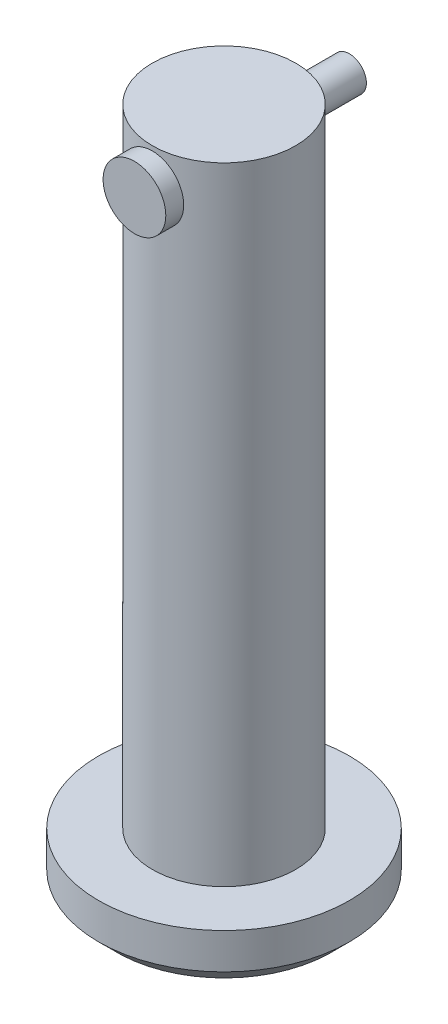
ISO-10303-21;
HEADER;
FILE_DESCRIPTION(('STEP AP214'),'2;1');
FILE_NAME('part.step','',(''),(''),'','','');
FILE_SCHEMA(('AUTOMOTIVE_DESIGN { 1 0 10303 214 1 1 1 1 }'));
ENDSEC;
DATA;
#1=APPLICATION_CONTEXT('core data for automotive mechanical design processes');
#2=APPLICATION_PROTOCOL_DEFINITION('international standard','automotive_design',2000,#1);
#3=PRODUCT_CONTEXT('',#1,'mechanical');
#4=PRODUCT('Part','Part','',(#3));
#5=PRODUCT_RELATED_PRODUCT_CATEGORY('part','',(#4));
#6=PRODUCT_DEFINITION_FORMATION('','',#4);
#7=PRODUCT_DEFINITION_CONTEXT('part definition',#1,'design');
#8=PRODUCT_DEFINITION('design','',#6,#7);
#9=PRODUCT_DEFINITION_SHAPE('','',#8);
#10=(LENGTH_UNIT() NAMED_UNIT(*) SI_UNIT(.MILLI.,.METRE.));
#11=(NAMED_UNIT(*) PLANE_ANGLE_UNIT() SI_UNIT($,.RADIAN.));
#12=(NAMED_UNIT(*) SI_UNIT($,.STERADIAN.) SOLID_ANGLE_UNIT());
#13=UNCERTAINTY_MEASURE_WITH_UNIT(LENGTH_MEASURE(1.E-05),#10,'distance_accuracy_value','');
#14=(GEOMETRIC_REPRESENTATION_CONTEXT(3) GLOBAL_UNCERTAINTY_ASSIGNED_CONTEXT((#13)) GLOBAL_UNIT_ASSIGNED_CONTEXT((#10,
#11,#12)) REPRESENTATION_CONTEXT('',''));
#15=CARTESIAN_POINT('',(0.,0.,0.));
#16=DIRECTION('',(0.,0.,1.));
#17=DIRECTION('',(1.,0.,0.));
#18=AXIS2_PLACEMENT_3D('',#15,#16,#17);
#19=CARTESIAN_POINT('',(0.,33.,-7.));
#20=DIRECTION('',(0.,0.,1.));
#21=DIRECTION('',(1.,0.,0.));
#22=AXIS2_PLACEMENT_3D('',#19,#20,#21);
#23=CYLINDRICAL_SURFACE('',#22,0.95);
#24=CARTESIAN_POINT('',(0.,33.,-7.));
#25=DIRECTION('',(0.,0.,1.));
#26=DIRECTION('',(1.,0.,0.));
#27=AXIS2_PLACEMENT_3D('',#24,#25,#26);
#28=CIRCLE('',#27,0.95);
#29=CARTESIAN_POINT('',(0.95,33.,-7.));
#30=VERTEX_POINT('',#29);
#31=EDGE_CURVE('E11',#30,#30,#28,.T.);
#32=ORIENTED_EDGE('',*,*,#31,.T.);
#33=EDGE_LOOP('',(#32));
#34=FACE_BOUND('',#33,.T.);
#35=CARTESIAN_POINT('',(0.,33.,4.));
#36=DIRECTION('',(0.,0.,1.));
#37=DIRECTION('',(1.,0.,0.));
#38=AXIS2_PLACEMENT_3D('',#35,#36,#37);
#39=CIRCLE('',#38,0.95);
#40=CARTESIAN_POINT('',(0.95,33.,4.));
#41=VERTEX_POINT('',#40);
#42=EDGE_CURVE('E44',#41,#41,#39,.F.);
#43=ORIENTED_EDGE('',*,*,#42,.T.);
#44=EDGE_LOOP('',(#43));
#45=FACE_BOUND('',#44,.T.);
#46=ADVANCED_FACE('F41',(#34,#45),#23,.T.);
#47=CARTESIAN_POINT('',(0.,33.,-7.));
#48=DIRECTION('',(0.,0.,1.));
#49=DIRECTION('',(1.,0.,0.));
#50=AXIS2_PLACEMENT_3D('',#47,#48,#49);
#51=PLANE('',#50);
#52=ORIENTED_EDGE('',*,*,#31,.F.);
#53=EDGE_LOOP('',(#52));
#54=FACE_BOUND('',#53,.T.);
#55=ADVANCED_FACE('F73',(#54),#51,.F.);
#56=CARTESIAN_POINT('',(0.,33.,4.));
#57=DIRECTION('',(0.,0.,1.));
#58=DIRECTION('',(1.,0.,0.));
#59=AXIS2_PLACEMENT_3D('',#56,#57,#58);
#60=CYLINDRICAL_SURFACE('',#59,1.75);
#61=CARTESIAN_POINT('',(0.,33.,4.));
#62=DIRECTION('',(0.,0.,1.));
#63=DIRECTION('',(1.,0.,0.));
#64=AXIS2_PLACEMENT_3D('',#61,#62,#63);
#65=CIRCLE('',#64,1.75);
#66=CARTESIAN_POINT('',(1.75,33.,4.));
#67=VERTEX_POINT('',#66);
#68=EDGE_CURVE('E51',#67,#67,#65,.T.);
#69=ORIENTED_EDGE('',*,*,#68,.T.);
#70=EDGE_LOOP('',(#69));
#71=FACE_BOUND('',#70,.T.);
#72=CARTESIAN_POINT('',(0.,33.,5.));
#73=DIRECTION('',(0.,0.,1.));
#74=DIRECTION('',(1.,0.,0.));
#75=AXIS2_PLACEMENT_3D('',#72,#73,#74);
#76=CIRCLE('',#75,1.75);
#77=CARTESIAN_POINT('',(1.75,33.,5.));
#78=VERTEX_POINT('',#77);
#79=EDGE_CURVE('E53',#78,#78,#76,.T.);
#80=ORIENTED_EDGE('',*,*,#79,.F.);
#81=EDGE_LOOP('',(#80));
#82=FACE_BOUND('',#81,.T.);
#83=ADVANCED_FACE('F59',(#71,#82),#60,.T.);
#84=CARTESIAN_POINT('',(0.,33.,4.));
#85=DIRECTION('',(0.,0.,1.));
#86=DIRECTION('',(1.,0.,0.));
#87=AXIS2_PLACEMENT_3D('',#84,#85,#86);
#88=PLANE('',#87);
#89=ORIENTED_EDGE('',*,*,#42,.F.);
#90=EDGE_LOOP('',(#89));
#91=FACE_BOUND('',#90,.T.);
#92=ORIENTED_EDGE('',*,*,#68,.F.);
#93=EDGE_LOOP('',(#92));
#94=FACE_BOUND('',#93,.T.);
#95=ADVANCED_FACE('F62',(#91,#94),#88,.F.);
#96=CARTESIAN_POINT('',(0.,33.,5.));
#97=DIRECTION('',(0.,0.,1.));
#98=DIRECTION('',(1.,0.,0.));
#99=AXIS2_PLACEMENT_3D('',#96,#97,#98);
#100=PLANE('',#99);
#101=ORIENTED_EDGE('',*,*,#79,.T.);
#102=EDGE_LOOP('',(#101));
#103=FACE_BOUND('',#102,.T.);
#104=ADVANCED_FACE('F64',(#103),#100,.T.);
#105=CLOSED_SHELL('',(#46,#55,#83,#95,#104));
#106=MANIFOLD_SOLID_BREP('B2',#105);
#107=CARTESIAN_POINT('',(0.,35.,0.));
#108=DIRECTION('',(0.,-1.,0.));
#109=DIRECTION('',(0.,0.,-1.));
#110=AXIS2_PLACEMENT_3D('',#107,#108,#109);
#111=CYLINDRICAL_SURFACE('',#110,4.);
#112=CARTESIAN_POINT('',(0.,35.,0.));
#113=DIRECTION('',(0.,1.,0.));
#114=DIRECTION('',(0.,0.,1.));
#115=AXIS2_PLACEMENT_3D('',#112,#113,#114);
#116=CIRCLE('',#115,4.);
#117=CARTESIAN_POINT('',(0.,35.,4.));
#118=VERTEX_POINT('',#117);
#119=EDGE_CURVE('E131',#118,#118,#116,.T.);
#120=ORIENTED_EDGE('',*,*,#119,.F.);
#121=EDGE_LOOP('',(#120));
#122=FACE_BOUND('',#121,.T.);
#123=CARTESIAN_POINT('',(0.,0.,0.));
#124=DIRECTION('',(0.,-1.,0.));
#125=DIRECTION('',(0.,0.,-1.));
#126=AXIS2_PLACEMENT_3D('',#123,#124,#125);
#127=CIRCLE('',#126,4.);
#128=CARTESIAN_POINT('',(0.,0.,-4.));
#129=VERTEX_POINT('',#128);
#130=EDGE_CURVE('E165',#129,#129,#127,.T.);
#131=ORIENTED_EDGE('',*,*,#130,.F.);
#132=EDGE_LOOP('',(#131));
#133=FACE_BOUND('',#132,.T.);
#134=CARTESIAN_POINT('',(-1.,33.,3.87298334620742));
#135=CARTESIAN_POINT('',(-0.9999984314387,32.9447796996432,3.87298440057185));
#136=CARTESIAN_POINT('',(-0.99541049820807,32.8895420405686,3.87417722499278));
#137=CARTESIAN_POINT('',(-0.977209250194447,32.7806529687674,3.87880744892249));
#138=CARTESIAN_POINT('',(-0.963590682698079,32.72700249822,3.8822461547418));
#139=CARTESIAN_POINT('',(-0.927796479849636,32.6228785847122,3.89095489813012));
#140=CARTESIAN_POINT('',(-0.905631891140942,32.5724011378422,3.8962225706936));
#141=CARTESIAN_POINT('',(-0.853408456505404,32.4758756589875,3.90799276818327));
#142=CARTESIAN_POINT('',(-0.823349275424504,32.4298278151688,3.91449534553241));
#143=CARTESIAN_POINT('',(-0.755483370924518,32.3424553418942,3.92816286540368));
#144=CARTESIAN_POINT('',(-0.717534755081558,32.3012425598597,3.93533839048709));
#145=CARTESIAN_POINT('',(-0.635272825640328,32.2256954422561,3.94945150206622));
#146=CARTESIAN_POINT('',(-0.59095891767214,32.1913617497514,3.95638906626691));
#147=CARTESIAN_POINT('',(-0.496458080431566,32.1300898129474,3.96936166208095));
#148=CARTESIAN_POINT('',(-0.446197830478045,32.1032614447354,3.975382749602));
#149=CARTESIAN_POINT('',(-0.341705273717112,32.0584761423388,3.9857232477043));
#150=CARTESIAN_POINT('',(-0.28747355431678,32.0405178992338,3.99004290933747));
#151=CARTESIAN_POINT('',(-0.177743503501667,32.0143408661686,3.99641903539262));
#152=CARTESIAN_POINT('',(-0.122293087819594,32.0059321422694,3.99851957537723));
#153=CARTESIAN_POINT('',(-0.0107315277051123,31.9984966482898,4.00037437642922));
#154=CARTESIAN_POINT('',(0.0453795178152228,31.9994684911162,4.00012898438682));
#155=CARTESIAN_POINT('',(0.155352247172383,32.0106299401001,3.99735237981413));
#156=CARTESIAN_POINT('',(0.209236215601063,32.0206145300215,3.99487200936349));
#157=CARTESIAN_POINT('',(0.314538247413683,32.0491885080194,3.98796334609942));
#158=CARTESIAN_POINT('',(0.365956179370436,32.067778354151,3.98353494959376));
#159=CARTESIAN_POINT('',(0.465406703501804,32.1132010282748,3.97315003880358));
#160=CARTESIAN_POINT('',(0.513404509766501,32.1401068178647,3.96718007878021));
#161=CARTESIAN_POINT('',(0.604275622340485,32.2013422716465,3.9543596152386));
#162=CARTESIAN_POINT('',(0.647148035085502,32.2356732274242,3.94750895860996));
#163=CARTESIAN_POINT('',(0.727774035084955,32.3118834967929,3.93345485507808));
#164=CARTESIAN_POINT('',(0.765357679075198,32.3539419569391,3.92624687810367));
#165=CARTESIAN_POINT('',(0.832976375963018,32.4438399894161,3.91246017406683));
#166=CARTESIAN_POINT('',(0.863011076046016,32.4916798317964,3.90588147642388));
#167=CARTESIAN_POINT('',(0.9147881290226,32.5921160136596,3.89408198732659));
#168=CARTESIAN_POINT('',(0.936489566970494,32.6447342921253,3.88886793490288));
#169=CARTESIAN_POINT('',(0.970685620636343,32.7530341872306,3.88047456055983));
#170=CARTESIAN_POINT('',(0.983182206552911,32.8087151455933,3.87729480324087));
#171=CARTESIAN_POINT('',(0.998331855466071,32.9199838006093,3.87342142415656));
#172=CARTESIAN_POINT('',(1.00123618956785,32.9755351173319,3.87266435637459));
#173=CARTESIAN_POINT('',(0.99780679620622,33.0863287746313,3.87354937392416));
#174=CARTESIAN_POINT('',(0.991473919139521,33.1415711431805,3.87519123840506));
#175=CARTESIAN_POINT('',(0.969970185575067,33.2492457059819,3.88062832781824));
#176=CARTESIAN_POINT('',(0.954945627312701,33.3017090906283,3.8843878809375));
#177=CARTESIAN_POINT('',(0.916647232668251,33.4033725831407,3.89360287308385));
#178=CARTESIAN_POINT('',(0.89337241908502,33.4525723036221,3.89905851299445));
#179=CARTESIAN_POINT('',(0.838708267174624,33.5473765111469,3.91118454837305));
#180=CARTESIAN_POINT('',(0.807168701534253,33.5928915360172,3.91787667442657));
#181=CARTESIAN_POINT('',(0.737060292934456,33.6780753451205,3.93166833228686));
#182=CARTESIAN_POINT('',(0.698490294805438,33.71774316666,3.93876793091388));
#183=CARTESIAN_POINT('',(0.614262720984725,33.7911244170284,3.95278961212643));
#184=CARTESIAN_POINT('',(0.568451952531594,33.8246640250195,3.95970280824734));
#185=CARTESIAN_POINT('',(0.47170268269468,33.8835743467805,3.97238886645493));
#186=CARTESIAN_POINT('',(0.420764448957597,33.9089454866433,3.97816178801584));
#187=CARTESIAN_POINT('',(0.315558201731097,33.9505784138112,3.98788046295326));
#188=CARTESIAN_POINT('',(0.261317381027888,33.9669057137516,3.99183932008964));
#189=CARTESIAN_POINT('',(0.150749760318812,33.9901841338434,3.99754117358315));
#190=CARTESIAN_POINT('',(0.094423365041247,33.9971370634956,3.99928459757363));
#191=CARTESIAN_POINT('',(-0.0170835264433241,34.0013675895755,4.00034169408811));
#192=CARTESIAN_POINT('',(-0.0722538269660308,33.9989017090954,3.99971978880008));
#193=CARTESIAN_POINT('',(-0.181367496414737,33.9849521727057,3.99625896457423));
#194=CARTESIAN_POINT('',(-0.235310901780883,33.9734687849869,3.99342011157094));
#195=CARTESIAN_POINT('',(-0.340171035644813,33.9419477802291,3.98585432853963));
#196=CARTESIAN_POINT('',(-0.391102494581017,33.9219565466854,3.98113764502669));
#197=CARTESIAN_POINT('',(-0.488917053041466,33.8740294209807,3.97031288913382));
#198=CARTESIAN_POINT('',(-0.535799641265048,33.8460925273304,3.96420464137727));
#199=CARTESIAN_POINT('',(-0.625401928423897,33.7822847660029,3.95107249681342));
#200=CARTESIAN_POINT('',(-0.667994988300584,33.7462398570926,3.94403016945647));
#201=CARTESIAN_POINT('',(-0.746615020271249,33.6675771480262,3.92990649053207));
#202=CARTESIAN_POINT('',(-0.782640325068177,33.6249576839021,3.92282512952424));
#203=CARTESIAN_POINT('',(-0.847762026479239,33.5333985857987,3.90927475860683));
#204=CARTESIAN_POINT('',(-0.876716619446591,33.4843558765875,3.90281963730391));
#205=CARTESIAN_POINT('',(-0.92592689661562,33.3819445100772,3.8914395555011));
#206=CARTESIAN_POINT('',(-0.946188909759556,33.3285790338927,3.88651348244814));
#207=CARTESIAN_POINT('',(-0.974422528565571,33.2294229881737,3.87951908741315));
#208=CARTESIAN_POINT('',(-0.983993170595829,33.1841068356176,3.87708663005761));
#209=CARTESIAN_POINT('',(-0.996782292572819,33.0925311309985,3.87381838580358));
#210=CARTESIAN_POINT('',(-1.00000131437052,33.0462716597494,3.87298246270639));
#211=CARTESIAN_POINT('',(-1.,33.,3.87298334620742));
#212=B_SPLINE_CURVE_WITH_KNOTS('',3,(#134,#135,#136,#137,#138,#139,#140,#141,#142,#143,#144,
#145,#146,#147,#148,#149,#150,#151,#152,#153,#154,#155,#156,#157,#158,#159,#160,#161,#162,#163,
#164,#165,#166,#167,#168,#169,#170,#171,#172,#173,#174,#175,#176,#177,#178,#179,#180,#181,#182,
#183,#184,#185,#186,#187,#188,#189,#190,#191,#192,#193,#194,#195,#196,#197,#198,#199,#200,#201,
#202,#203,#204,#205,#206,#207,#208,#209,#210,#211),.UNSPECIFIED.,.T.,.F.,(4,2,2,2,2,2,2,2,2,2,2,
2,2,2,2,2,2,2,2,2,2,2,2,2,2,2,2,2,2,2,2,2,2,2,2,2,2,2,4),(0.,0.165490976675223,
0.331078296534208,0.496452290829161,0.66183330698466,0.830495816734648,0.99917408588221,
1.17020598555442,1.34121263935111,1.50875500394413,1.67627259462682,1.84007305071853,
2.00388222686189,2.16917149698052,2.33448954183839,2.50428186625039,2.67408212476195,
2.84470572799636,3.01529280048094,3.18137429900961,3.34744050869795,3.51078961999957,
3.67415808564842,3.84073138339938,4.00733207550293,4.17810132382402,4.34886166284095,
4.51836829119046,4.6878421955989,4.85273378447257,5.01762046947067,5.18161950620159,
5.34563922291503,5.51358838629103,5.68158012622478,5.85270590910145,6.02370688542922,
6.16239130867207,6.30106390036083),.UNSPECIFIED.);
#213=CARTESIAN_POINT('',(-1.,33.,3.87298334620742));
#214=VERTEX_POINT('',#213);
#215=EDGE_CURVE('E134',#214,#214,#212,.T.);
#216=ORIENTED_EDGE('',*,*,#215,.F.);
#217=EDGE_LOOP('',(#216));
#218=FACE_BOUND('',#217,.T.);
#219=CARTESIAN_POINT('',(0.,34.,-4.));
#220=CARTESIAN_POINT('',(0.0552507257798211,33.9999984495079,-3.99999906578675));
#221=CARTESIAN_POINT('',(0.110518771887176,33.9954056328175,-3.99884385421219));
#222=CARTESIAN_POINT('',(0.219470882513689,33.977183232462,-3.99434742553261));
#223=CARTESIAN_POINT('',(0.27315403124716,33.9635485269748,-3.99100496946646));
#224=CARTESIAN_POINT('',(0.37734724812172,33.9277071643586,-3.98250417554693));
#225=CARTESIAN_POINT('',(0.427861042286672,33.9055108008565,-3.97734801894724));
#226=CARTESIAN_POINT('',(0.524448087936288,33.8532124066368,-3.96576895871729));
#227=CARTESIAN_POINT('',(0.570521189565842,33.823110109254,-3.95934601236034));
#228=CARTESIAN_POINT('',(0.657867951533948,33.7551994735639,-3.94578275727868));
#229=CARTESIAN_POINT('',(0.699037126707383,33.7172589500272,-3.93863138099022));
#230=CARTESIAN_POINT('',(0.774499284802205,33.6350318633941,-3.92449080078353));
#231=CARTESIAN_POINT('',(0.808791491299426,33.5907445847023,-3.91750161525566));
#232=CARTESIAN_POINT('',(0.870017695199357,33.4962698488417,-3.9043651713314));
#233=CARTESIAN_POINT('',(0.896834810616906,33.4460045127931,-3.89823196313737));
#234=CARTESIAN_POINT('',(0.941597939033685,33.3415010588944,-3.88766329874815));
#235=CARTESIAN_POINT('',(0.959545370292889,33.2872635777828,-3.88322757115192));
#236=CARTESIAN_POINT('',(0.985703224536195,33.1775043345317,-3.87666984478367));
#237=CARTESIAN_POINT('',(0.994101512222227,33.1220300693001,-3.87450327383617));
#238=CARTESIAN_POINT('',(1.00150785004524,33.0104209539907,-3.8725957502516));
#239=CARTESIAN_POINT('',(1.00051742787865,32.9542862128676,-3.87285440299096));
#240=CARTESIAN_POINT('',(0.98932434975952,32.8443894615037,-3.87572803664412));
#241=CARTESIAN_POINT('',(0.979345560127013,32.7906029190233,-3.87828575334586));
#242=CARTESIAN_POINT('',(0.950816124602071,32.6854926327258,-3.88537806450989));
#243=CARTESIAN_POINT('',(0.932264868046283,32.6341690646473,-3.88991279980464));
#244=CARTESIAN_POINT('',(0.88692631862477,32.5348413224986,-3.90050075936124));
#245=CARTESIAN_POINT('',(0.860057778155274,32.4868758854736,-3.90656884979614));
#246=CARTESIAN_POINT('',(0.798904184009968,32.3960541934954,-3.91953140564257));
#247=CARTESIAN_POINT('',(0.764617832539224,32.3531988346218,-3.9264260155649));
#248=CARTESIAN_POINT('',(0.688442283120808,32.2725309228704,-3.94050587026521));
#249=CARTESIAN_POINT('',(0.646364172110569,32.2348970066258,-3.94769379651981));
#250=CARTESIAN_POINT('',(0.556407945002461,32.1671858383574,-3.96137310385857));
#251=CARTESIAN_POINT('',(0.50852965180529,32.1371088171576,-3.96786446366277));
#252=CARTESIAN_POINT('',(0.408077259120922,32.0852996091837,-3.97945154729455));
#253=CARTESIAN_POINT('',(0.35548759547241,32.0635964398304,-3.9845424008515));
#254=CARTESIAN_POINT('',(0.247250672095251,32.0293884628603,-3.99271944660946));
#255=CARTESIAN_POINT('',(0.191603999433652,32.0168818957212,-3.99580602226187));
#256=CARTESIAN_POINT('',(0.0803599802600139,32.0016949562941,-3.9995699951425));
#257=CARTESIAN_POINT('',(0.0247978133254694,31.9987713159498,-4.00030702338852));
#258=CARTESIAN_POINT('',(-0.0860219165343418,32.0021660013703,-3.999458698763));
#259=CARTESIAN_POINT('',(-0.141279506429733,32.0084834951994,-3.99787355494564));
#260=CARTESIAN_POINT('',(-0.24907617918433,32.0299806055943,-3.99259720751571));
#261=CARTESIAN_POINT('',(-0.301643412645839,32.0450275089847,-3.98893756123874));
#262=CARTESIAN_POINT('',(-0.40350486163501,32.0834047226856,-3.97992471089423));
#263=CARTESIAN_POINT('',(-0.452798746021758,32.1067358695421,-3.97457133579928));
#264=CARTESIAN_POINT('',(-0.547682089619899,32.1614907525831,-3.96262205284207));
#265=CARTESIAN_POINT('',(-0.593190294557221,32.1930507415978,-3.95600578244621));
#266=CARTESIAN_POINT('',(-0.678351075762165,32.2631932725313,-3.94229672791613));
#267=CARTESIAN_POINT('',(-0.71800263931534,32.3017770264113,-3.93520386167803));
#268=CARTESIAN_POINT('',(-0.791327045381821,32.3860013072296,-3.92112637973847));
#269=CARTESIAN_POINT('',(-0.824829245081355,32.4317918020016,-3.91414869458187));
#270=CARTESIAN_POINT('',(-0.883673839341799,32.5284884229771,-3.90128585584826));
#271=CARTESIAN_POINT('',(-0.909016596105292,32.5793943219732,-3.89540065378017));
#272=CARTESIAN_POINT('',(-0.950634280406197,32.6846038149421,-3.88545396489777));
#273=CARTESIAN_POINT('',(-0.966962931102711,32.7388850855627,-3.88138170194604));
#274=CARTESIAN_POINT('',(-0.990230439969186,32.8495397585927,-3.87551162726789));
#275=CARTESIAN_POINT('',(-0.997171351652438,32.9059127006883,-3.87371331813291));
#276=CARTESIAN_POINT('',(-1.00135906022266,33.0174140159035,-3.87263267469304));
#277=CARTESIAN_POINT('',(-0.998878598520081,33.0725316234165,-3.87327955152176));
#278=CARTESIAN_POINT('',(-0.984918185541914,33.1815359257786,-3.87685272671895));
#279=CARTESIAN_POINT('',(-0.973438415124514,33.2354226453424,-3.87977897927904));
#280=CARTESIAN_POINT('',(-0.941954212961864,33.3401389727103,-3.88754173788482));
#281=CARTESIAN_POINT('',(-0.922000936453585,33.3909848701601,-3.89236676824206));
#282=CARTESIAN_POINT('',(-0.874176609070049,33.4886435884758,-3.90338503816552));
#283=CARTESIAN_POINT('',(-0.846304460022793,33.5354558487913,-3.90957846747182));
#284=CARTESIAN_POINT('',(-0.782578499091425,33.6250364193347,-3.92283756175675));
#285=CARTESIAN_POINT('',(-0.746535441941504,33.6676673822827,-3.92992176554505));
#286=CARTESIAN_POINT('',(-0.667859580793158,33.7463646965303,-3.94405351497524));
#287=CARTESIAN_POINT('',(-0.625225214174097,33.782429486742,-3.95110105151373));
#288=CARTESIAN_POINT('',(-0.533645057801726,33.8476075390431,-3.96451770431775));
#289=CARTESIAN_POINT('',(-0.484598948210922,33.8765830757811,-3.97087222243912));
#290=CARTESIAN_POINT('',(-0.382177373006982,33.9258316419604,-3.98203283316746));
#291=CARTESIAN_POINT('',(-0.328805042291159,33.946110907099,-3.98684003466521));
#292=CARTESIAN_POINT('',(-0.229606835495648,33.9743812202198,-3.99365373043694));
#293=CARTESIAN_POINT('',(-0.184253447272046,33.983967495369,-3.9960172336846));
#294=CARTESIAN_POINT('',(-0.0926040476908554,33.996777295748,-3.99919070154632));
#295=CARTESIAN_POINT('',(-0.0463081074950776,34.0000012995369,-4.00000078300596));
#296=CARTESIAN_POINT('',(0.,34.,-4.));
#297=B_SPLINE_CURVE_WITH_KNOTS('',3,(#219,#220,#221,#222,#223,#224,#225,#226,#227,#228,#229,
#230,#231,#232,#233,#234,#235,#236,#237,#238,#239,#240,#241,#242,#243,#244,#245,#246,#247,#248,
#249,#250,#251,#252,#253,#254,#255,#256,#257,#258,#259,#260,#261,#262,#263,#264,#265,#266,#267,
#268,#269,#270,#271,#272,#273,#274,#275,#276,#277,#278,#279,#280,#281,#282,#283,#284,#285,#286,
#287,#288,#289,#290,#291,#292,#293,#294,#295,#296),.UNSPECIFIED.,.T.,.F.,(4,2,2,2,2,2,2,2,2,2,2,
2,2,2,2,2,2,2,2,2,2,2,2,2,2,2,2,2,2,2,2,2,2,2,2,2,2,2,4),(0.,0.165582474981261,
0.331258825175935,0.496736601524073,0.662219960112887,0.830762902914266,0.999324863867081,
1.17039098363872,1.34142974112912,1.50904196732954,1.67662692075132,1.84014998004679,
2.00368468977359,2.16887018582587,2.33408460557443,2.50401000646014,2.67394059705499,
2.84445486006077,3.01493649125763,3.18105539299518,3.34715934075162,3.51080183009359,
3.67446084881527,3.84102391710235,4.0076157533868,4.17829672802984,4.34897012499672,
4.51861503076025,4.68822282168272,4.85295853599075,5.01769093970689,5.18144267039632,
5.34521712091268,5.51326384273274,5.68135046513612,5.85248123666393,6.02348909214234,
6.16228161961433,6.3010637069536),.UNSPECIFIED.);
#298=CARTESIAN_POINT('',(0.,34.,-4.));
#299=VERTEX_POINT('',#298);
#300=EDGE_CURVE('E119',#299,#299,#297,.T.);
#301=ORIENTED_EDGE('',*,*,#300,.F.);
#302=EDGE_LOOP('',(#301));
#303=FACE_BOUND('',#302,.T.);
#304=ADVANCED_FACE('F115',(#122,#133,#218,#303),#111,.T.);
#305=CARTESIAN_POINT('',(0.,35.,0.));
#306=DIRECTION('',(0.,1.,0.));
#307=DIRECTION('',(0.,0.,1.));
#308=AXIS2_PLACEMENT_3D('',#305,#306,#307);
#309=PLANE('',#308);
#310=ORIENTED_EDGE('',*,*,#119,.T.);
#311=EDGE_LOOP('',(#310));
#312=FACE_BOUND('',#311,.T.);
#313=ADVANCED_FACE('F156',(#312),#309,.T.);
#314=CARTESIAN_POINT('',(0.,-3.,0.));
#315=DIRECTION('',(0.,1.,0.));
#316=DIRECTION('',(0.,0.,1.));
#317=AXIS2_PLACEMENT_3D('',#314,#315,#316);
#318=CYLINDRICAL_SURFACE('',#317,7.);
#319=CARTESIAN_POINT('',(0.,-1.99999999999999,0.));
#320=DIRECTION('',(0.,-1.,0.));
#321=DIRECTION('',(0.,0.,-1.));
#322=AXIS2_PLACEMENT_3D('',#319,#320,#321);
#323=CIRCLE('',#322,7.);
#324=CARTESIAN_POINT('',(0.,-1.99999999999999,-7.));
#325=VERTEX_POINT('',#324);
#326=EDGE_CURVE('E40',#325,#325,#323,.F.);
#327=ORIENTED_EDGE('',*,*,#326,.T.);
#328=EDGE_LOOP('',(#327));
#329=FACE_BOUND('',#328,.T.);
#330=CARTESIAN_POINT('',(0.,0.,0.));
#331=DIRECTION('',(0.,-1.,0.));
#332=DIRECTION('',(0.,0.,-1.));
#333=AXIS2_PLACEMENT_3D('',#330,#331,#332);
#334=CIRCLE('',#333,7.);
#335=CARTESIAN_POINT('',(0.,0.,-7.));
#336=VERTEX_POINT('',#335);
#337=EDGE_CURVE('E167',#336,#336,#334,.T.);
#338=ORIENTED_EDGE('',*,*,#337,.T.);
#339=EDGE_LOOP('',(#338));
#340=FACE_BOUND('',#339,.T.);
#341=ADVANCED_FACE('F150',(#329,#340),#318,.T.);
#342=CARTESIAN_POINT('',(0.,-3.,0.));
#343=DIRECTION('',(0.,-1.,0.));
#344=DIRECTION('',(0.,0.,-1.));
#345=AXIS2_PLACEMENT_3D('',#342,#343,#344);
#346=PLANE('',#345);
#347=CARTESIAN_POINT('',(0.,-3.,0.));
#348=DIRECTION('',(0.,-1.,0.));
#349=DIRECTION('',(0.,0.,-1.));
#350=AXIS2_PLACEMENT_3D('',#347,#348,#349);
#351=CIRCLE('',#350,6.);
#352=CARTESIAN_POINT('',(0.,-3.,-6.));
#353=VERTEX_POINT('',#352);
#354=EDGE_CURVE('E126',#353,#353,#351,.T.);
#355=ORIENTED_EDGE('',*,*,#354,.T.);
#356=EDGE_LOOP('',(#355));
#357=FACE_BOUND('',#356,.T.);
#358=ADVANCED_FACE('F145',(#357),#346,.T.);
#359=CARTESIAN_POINT('',(0.,0.,0.));
#360=DIRECTION('',(0.,-1.,0.));
#361=DIRECTION('',(0.,0.,-1.));
#362=AXIS2_PLACEMENT_3D('',#359,#360,#361);
#363=PLANE('',#362);
#364=ORIENTED_EDGE('',*,*,#130,.T.);
#365=EDGE_LOOP('',(#364));
#366=FACE_BOUND('',#365,.T.);
#367=ORIENTED_EDGE('',*,*,#337,.F.);
#368=EDGE_LOOP('',(#367));
#369=FACE_BOUND('',#368,.T.);
#370=ADVANCED_FACE('F149',(#366,#369),#363,.F.);
#371=CARTESIAN_POINT('',(0.,-3.,0.));
#372=DIRECTION('',(0.,1.,0.));
#373=DIRECTION('',(0.,0.,1.));
#374=AXIS2_PLACEMENT_3D('',#371,#372,#373);
#375=CONICAL_SURFACE('',#374,6.,0.785398163397447);
#376=ORIENTED_EDGE('',*,*,#326,.F.);
#377=EDGE_LOOP('',(#376));
#378=FACE_BOUND('',#377,.T.);
#379=ORIENTED_EDGE('',*,*,#354,.F.);
#380=EDGE_LOOP('',(#379));
#381=FACE_BOUND('',#380,.T.);
#382=ADVANCED_FACE('F117',(#378,#381),#375,.T.);
#383=CARTESIAN_POINT('',(0.,33.,10.));
#384=DIRECTION('',(0.,0.,-1.));
#385=DIRECTION('',(-1.,0.,0.));
#386=AXIS2_PLACEMENT_3D('',#383,#384,#385);
#387=CYLINDRICAL_SURFACE('',#386,1.);
#388=ORIENTED_EDGE('',*,*,#215,.T.);
#389=EDGE_LOOP('',(#388));
#390=FACE_BOUND('',#389,.T.);
#391=ORIENTED_EDGE('',*,*,#300,.T.);
#392=EDGE_LOOP('',(#391));
#393=FACE_BOUND('',#392,.T.);
#394=ADVANCED_FACE('F140',(#390,#393),#387,.F.);
#395=CLOSED_SHELL('',(#304,#313,#341,#358,#370,#382,#394));
#396=MANIFOLD_SOLID_BREP('B6',#395);
#397=ADVANCED_BREP_SHAPE_REPRESENTATION('',(#18,#106,#396),#14);
#398=SHAPE_DEFINITION_REPRESENTATION(#9,#397);
ENDSEC;
END-ISO-10303-21;
